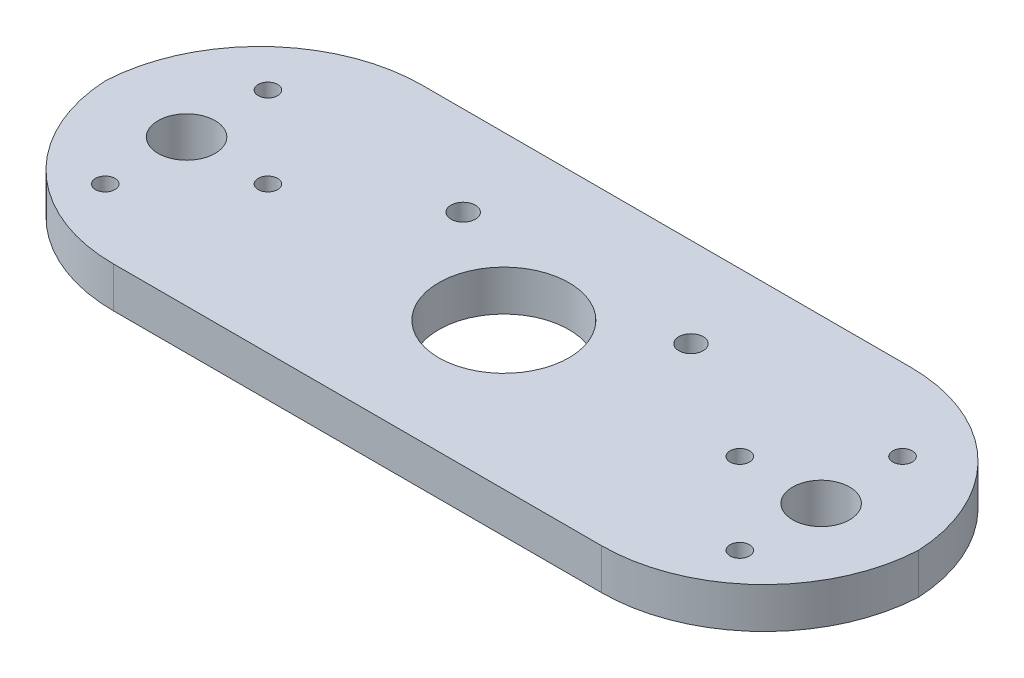
ISO-10303-21;
HEADER;
FILE_DESCRIPTION(('STEP AP214'),'2;1');
FILE_NAME('part.step','',(''),(''),'','','');
FILE_SCHEMA(('AUTOMOTIVE_DESIGN { 1 0 10303 214 1 1 1 1 }'));
ENDSEC;
DATA;
#1=APPLICATION_CONTEXT('core data for automotive mechanical design processes');
#2=APPLICATION_PROTOCOL_DEFINITION('international standard','automotive_design',2000,#1);
#3=PRODUCT_CONTEXT('',#1,'mechanical');
#4=PRODUCT('Part','Part','',(#3));
#5=PRODUCT_RELATED_PRODUCT_CATEGORY('part','',(#4));
#6=PRODUCT_DEFINITION_FORMATION('','',#4);
#7=PRODUCT_DEFINITION_CONTEXT('part definition',#1,'design');
#8=PRODUCT_DEFINITION('design','',#6,#7);
#9=PRODUCT_DEFINITION_SHAPE('','',#8);
#10=(LENGTH_UNIT() NAMED_UNIT(*) SI_UNIT(.MILLI.,.METRE.));
#11=(NAMED_UNIT(*) PLANE_ANGLE_UNIT() SI_UNIT($,.RADIAN.));
#12=(NAMED_UNIT(*) SI_UNIT($,.STERADIAN.) SOLID_ANGLE_UNIT());
#13=UNCERTAINTY_MEASURE_WITH_UNIT(LENGTH_MEASURE(1.E-05),#10,'distance_accuracy_value','');
#14=(GEOMETRIC_REPRESENTATION_CONTEXT(3) GLOBAL_UNCERTAINTY_ASSIGNED_CONTEXT((#13)) GLOBAL_UNIT_ASSIGNED_CONTEXT((#10,
#11,#12)) REPRESENTATION_CONTEXT('',''));
#15=CARTESIAN_POINT('',(0.,0.,0.));
#16=DIRECTION('',(0.,0.,1.));
#17=DIRECTION('',(1.,0.,0.));
#18=AXIS2_PLACEMENT_3D('',#15,#16,#17);
#19=CARTESIAN_POINT('',(0.,5.,0.));
#20=DIRECTION('',(0.,1.,0.));
#21=DIRECTION('',(0.,0.,1.));
#22=AXIS2_PLACEMENT_3D('',#19,#20,#21);
#23=PLANE('',#22);
#24=CARTESIAN_POINT('',(-39.0000000000007,5.,-9.99999999999995));
#25=DIRECTION('',(0.,1.,0.));
#26=DIRECTION('',(0.,0.,1.));
#27=AXIS2_PLACEMENT_3D('',#24,#25,#26);
#28=CIRCLE('',#27,1.19999999999999);
#29=CARTESIAN_POINT('',(-39.0000000000007,5.,-8.79999999999997));
#30=VERTEX_POINT('',#29);
#31=EDGE_CURVE('E368',#30,#30,#28,.T.);
#32=ORIENTED_EDGE('',*,*,#31,.F.);
#33=EDGE_LOOP('',(#32));
#34=FACE_BOUND('',#33,.T.);
#35=CARTESIAN_POINT('',(-39.0000000000007,5.,10.));
#36=DIRECTION('',(0.,1.,0.));
#37=DIRECTION('',(0.,0.,1.));
#38=AXIS2_PLACEMENT_3D('',#35,#36,#37);
#39=CIRCLE('',#38,1.19999999999999);
#40=CARTESIAN_POINT('',(-39.0000000000007,5.,11.2));
#41=VERTEX_POINT('',#40);
#42=EDGE_CURVE('E370',#41,#41,#39,.T.);
#43=ORIENTED_EDGE('',*,*,#42,.F.);
#44=EDGE_LOOP('',(#43));
#45=FACE_BOUND('',#44,.T.);
#46=CARTESIAN_POINT('',(-29.0000000000007,5.,0.));
#47=DIRECTION('',(0.,1.,0.));
#48=DIRECTION('',(0.,0.,1.));
#49=AXIS2_PLACEMENT_3D('',#46,#47,#48);
#50=CIRCLE('',#49,1.19999999999999);
#51=CARTESIAN_POINT('',(-29.0000000000007,5.,1.20000000000003));
#52=VERTEX_POINT('',#51);
#53=EDGE_CURVE('E378',#52,#52,#50,.T.);
#54=ORIENTED_EDGE('',*,*,#53,.F.);
#55=EDGE_LOOP('',(#54));
#56=FACE_BOUND('',#55,.T.);
#57=CARTESIAN_POINT('',(39.0000000000007,5.,-9.99999999999995));
#58=DIRECTION('',(0.,1.,0.));
#59=DIRECTION('',(0.,0.,1.));
#60=AXIS2_PLACEMENT_3D('',#57,#58,#59);
#61=CIRCLE('',#60,1.19999999999999);
#62=CARTESIAN_POINT('',(39.0000000000007,5.,-8.79999999999997));
#63=VERTEX_POINT('',#62);
#64=EDGE_CURVE('E384',#63,#63,#61,.T.);
#65=ORIENTED_EDGE('',*,*,#64,.F.);
#66=EDGE_LOOP('',(#65));
#67=FACE_BOUND('',#66,.T.);
#68=CARTESIAN_POINT('',(39.0000000000007,5.,10.));
#69=DIRECTION('',(0.,1.,0.));
#70=DIRECTION('',(0.,0.,1.));
#71=AXIS2_PLACEMENT_3D('',#68,#69,#70);
#72=CIRCLE('',#71,1.19999999999999);
#73=CARTESIAN_POINT('',(39.0000000000007,5.,11.2));
#74=VERTEX_POINT('',#73);
#75=EDGE_CURVE('E390',#74,#74,#72,.T.);
#76=ORIENTED_EDGE('',*,*,#75,.F.);
#77=EDGE_LOOP('',(#76));
#78=FACE_BOUND('',#77,.T.);
#79=CARTESIAN_POINT('',(29.0000000000007,5.,0.));
#80=DIRECTION('',(0.,1.,0.));
#81=DIRECTION('',(0.,0.,1.));
#82=AXIS2_PLACEMENT_3D('',#79,#80,#81);
#83=CIRCLE('',#82,1.19999999999999);
#84=CARTESIAN_POINT('',(29.0000000000007,5.,1.20000000000003));
#85=VERTEX_POINT('',#84);
#86=EDGE_CURVE('E396',#85,#85,#83,.T.);
#87=ORIENTED_EDGE('',*,*,#86,.F.);
#88=EDGE_LOOP('',(#87));
#89=FACE_BOUND('',#88,.T.);
#90=CARTESIAN_POINT('',(14.0000000000001,5.,-8.99999999999908));
#91=DIRECTION('',(0.,1.,0.));
#92=DIRECTION('',(0.,0.,1.));
#93=AXIS2_PLACEMENT_3D('',#90,#91,#92);
#94=CIRCLE('',#93,1.49999999999999);
#95=CARTESIAN_POINT('',(14.0000000000001,5.,-7.49999999999909));
#96=VERTEX_POINT('',#95);
#97=EDGE_CURVE('E402',#96,#96,#94,.T.);
#98=ORIENTED_EDGE('',*,*,#97,.F.);
#99=EDGE_LOOP('',(#98));
#100=FACE_BOUND('',#99,.T.);
#101=CARTESIAN_POINT('',(-14.,5.,-8.99999999999908));
#102=DIRECTION('',(0.,1.,0.));
#103=DIRECTION('',(0.,0.,1.));
#104=AXIS2_PLACEMENT_3D('',#101,#102,#103);
#105=CIRCLE('',#104,1.49999999999999);
#106=CARTESIAN_POINT('',(-14.,5.,-7.49999999999909));
#107=VERTEX_POINT('',#106);
#108=EDGE_CURVE('E138',#107,#107,#105,.T.);
#109=ORIENTED_EDGE('',*,*,#108,.F.);
#110=EDGE_LOOP('',(#109));
#111=FACE_BOUND('',#110,.T.);
#112=CARTESIAN_POINT('',(39.,5.,0.));
#113=DIRECTION('',(0.,1.,0.));
#114=DIRECTION('',(0.,0.,1.));
#115=AXIS2_PLACEMENT_3D('',#112,#113,#114);
#116=CIRCLE('',#115,3.5);
#117=CARTESIAN_POINT('',(39.,5.,3.5));
#118=VERTEX_POINT('',#117);
#119=EDGE_CURVE('E150',#118,#118,#116,.T.);
#120=ORIENTED_EDGE('',*,*,#119,.F.);
#121=EDGE_LOOP('',(#120));
#122=FACE_BOUND('',#121,.T.);
#123=DIRECTION('',(-1.,0.,0.));
#124=VECTOR('',#123,1.);
#125=CARTESIAN_POINT('',(-50.,5.,-20.));
#126=LINE('',#125,#124);
#127=CARTESIAN_POINT('',(30.,5.,-20.));
#128=VERTEX_POINT('',#127);
#129=CARTESIAN_POINT('',(-30.,5.,-20.));
#130=VERTEX_POINT('',#129);
#131=EDGE_CURVE('E102',#128,#130,#126,.T.);
#132=ORIENTED_EDGE('',*,*,#131,.T.);
#133=CARTESIAN_POINT('',(-30.,5.,0.));
#134=DIRECTION('',(0.,1.,0.));
#135=DIRECTION('',(0.,0.,1.));
#136=AXIS2_PLACEMENT_3D('',#133,#134,#135);
#137=CIRCLE('',#136,20.);
#138=CARTESIAN_POINT('',(-49.9749843554382,5.,-1.));
#139=VERTEX_POINT('',#138);
#140=EDGE_CURVE('E50',#130,#139,#137,.T.);
#141=ORIENTED_EDGE('',*,*,#140,.T.);
#142=CARTESIAN_POINT('',(-30.,5.,-2.00000000000001));
#143=DIRECTION('',(0.,1.,0.));
#144=DIRECTION('',(0.,0.,1.));
#145=AXIS2_PLACEMENT_3D('',#142,#143,#144);
#146=CIRCLE('',#145,20.);
#147=CARTESIAN_POINT('',(-30.,5.,18.));
#148=VERTEX_POINT('',#147);
#149=EDGE_CURVE('E125',#139,#148,#146,.T.);
#150=ORIENTED_EDGE('',*,*,#149,.T.);
#151=DIRECTION('',(1.,0.,0.));
#152=VECTOR('',#151,1.);
#153=CARTESIAN_POINT('',(-50.,5.,18.));
#154=LINE('',#153,#152);
#155=CARTESIAN_POINT('',(30.,5.,18.));
#156=VERTEX_POINT('',#155);
#157=EDGE_CURVE('E92',#148,#156,#154,.T.);
#158=ORIENTED_EDGE('',*,*,#157,.T.);
#159=CARTESIAN_POINT('',(30.,5.,-2.00000000000001));
#160=DIRECTION('',(0.,1.,0.));
#161=DIRECTION('',(0.,0.,1.));
#162=AXIS2_PLACEMENT_3D('',#159,#160,#161);
#163=CIRCLE('',#162,20.);
#164=CARTESIAN_POINT('',(49.9749843554382,5.,-0.999999999999935));
#165=VERTEX_POINT('',#164);
#166=EDGE_CURVE('E57',#156,#165,#163,.T.);
#167=ORIENTED_EDGE('',*,*,#166,.T.);
#168=CARTESIAN_POINT('',(30.,5.,0.));
#169=DIRECTION('',(0.,1.,0.));
#170=DIRECTION('',(0.,0.,1.));
#171=AXIS2_PLACEMENT_3D('',#168,#169,#170);
#172=CIRCLE('',#171,20.);
#173=EDGE_CURVE('E123',#165,#128,#172,.T.);
#174=ORIENTED_EDGE('',*,*,#173,.T.);
#175=EDGE_LOOP('',(#132,#141,#150,#158,#167,#174));
#176=FACE_BOUND('',#175,.T.);
#177=CARTESIAN_POINT('',(-3.10088955633979E-12,5.,3.71938256118619E-12));
#178=DIRECTION('',(0.,1.,0.));
#179=DIRECTION('',(0.,0.,1.));
#180=AXIS2_PLACEMENT_3D('',#177,#178,#179);
#181=CIRCLE('',#180,8.00000000000408);
#182=CARTESIAN_POINT('',(-3.10088955633979E-12,5.,8.0000000000078));
#183=VERTEX_POINT('',#182);
#184=EDGE_CURVE('E156',#183,#183,#181,.T.);
#185=ORIENTED_EDGE('',*,*,#184,.F.);
#186=EDGE_LOOP('',(#185));
#187=FACE_BOUND('',#186,.T.);
#188=CARTESIAN_POINT('',(-39.,5.,0.));
#189=DIRECTION('',(0.,1.,0.));
#190=DIRECTION('',(0.,0.,-1.));
#191=AXIS2_PLACEMENT_3D('',#188,#189,#190);
#192=CIRCLE('',#191,3.5);
#193=CARTESIAN_POINT('',(-39.,5.,-3.5));
#194=VERTEX_POINT('',#193);
#195=EDGE_CURVE('E131',#194,#194,#192,.T.);
#196=ORIENTED_EDGE('',*,*,#195,.F.);
#197=EDGE_LOOP('',(#196));
#198=FACE_BOUND('',#197,.T.);
#199=ADVANCED_FACE('F33',(#34,#45,#56,#67,#78,#89,#100,#111,#122,#176,#187,#198),#23,.T.);
#200=CARTESIAN_POINT('',(0.,0.,0.));
#201=DIRECTION('',(0.,1.,0.));
#202=DIRECTION('',(0.,0.,1.));
#203=AXIS2_PLACEMENT_3D('',#200,#201,#202);
#204=PLANE('',#203);
#205=CARTESIAN_POINT('',(-39.0000000000007,0.,-9.99999999999995));
#206=DIRECTION('',(0.,1.,0.));
#207=DIRECTION('',(0.,0.,1.));
#208=AXIS2_PLACEMENT_3D('',#205,#206,#207);
#209=CIRCLE('',#208,1.19999999999999);
#210=CARTESIAN_POINT('',(-39.0000000000007,0.,-8.79999999999997));
#211=VERTEX_POINT('',#210);
#212=EDGE_CURVE('E366',#211,#211,#209,.T.);
#213=ORIENTED_EDGE('',*,*,#212,.T.);
#214=EDGE_LOOP('',(#213));
#215=FACE_BOUND('',#214,.T.);
#216=CARTESIAN_POINT('',(-39.0000000000007,0.,10.));
#217=DIRECTION('',(0.,1.,0.));
#218=DIRECTION('',(0.,0.,1.));
#219=AXIS2_PLACEMENT_3D('',#216,#217,#218);
#220=CIRCLE('',#219,1.19999999999999);
#221=CARTESIAN_POINT('',(-39.0000000000007,0.,11.2));
#222=VERTEX_POINT('',#221);
#223=EDGE_CURVE('E375',#222,#222,#220,.T.);
#224=ORIENTED_EDGE('',*,*,#223,.T.);
#225=EDGE_LOOP('',(#224));
#226=FACE_BOUND('',#225,.T.);
#227=CARTESIAN_POINT('',(-29.0000000000007,0.,0.));
#228=DIRECTION('',(0.,1.,0.));
#229=DIRECTION('',(0.,0.,1.));
#230=AXIS2_PLACEMENT_3D('',#227,#228,#229);
#231=CIRCLE('',#230,1.19999999999999);
#232=CARTESIAN_POINT('',(-29.0000000000007,0.,1.20000000000003));
#233=VERTEX_POINT('',#232);
#234=EDGE_CURVE('E381',#233,#233,#231,.T.);
#235=ORIENTED_EDGE('',*,*,#234,.T.);
#236=EDGE_LOOP('',(#235));
#237=FACE_BOUND('',#236,.T.);
#238=CARTESIAN_POINT('',(39.0000000000007,0.,-9.99999999999995));
#239=DIRECTION('',(0.,1.,0.));
#240=DIRECTION('',(0.,0.,1.));
#241=AXIS2_PLACEMENT_3D('',#238,#239,#240);
#242=CIRCLE('',#241,1.19999999999999);
#243=CARTESIAN_POINT('',(39.0000000000007,0.,-8.79999999999997));
#244=VERTEX_POINT('',#243);
#245=EDGE_CURVE('E387',#244,#244,#242,.T.);
#246=ORIENTED_EDGE('',*,*,#245,.T.);
#247=EDGE_LOOP('',(#246));
#248=FACE_BOUND('',#247,.T.);
#249=CARTESIAN_POINT('',(39.0000000000007,0.,10.));
#250=DIRECTION('',(0.,1.,0.));
#251=DIRECTION('',(0.,0.,1.));
#252=AXIS2_PLACEMENT_3D('',#249,#250,#251);
#253=CIRCLE('',#252,1.19999999999999);
#254=CARTESIAN_POINT('',(39.0000000000007,0.,11.2));
#255=VERTEX_POINT('',#254);
#256=EDGE_CURVE('E393',#255,#255,#253,.T.);
#257=ORIENTED_EDGE('',*,*,#256,.T.);
#258=EDGE_LOOP('',(#257));
#259=FACE_BOUND('',#258,.T.);
#260=CARTESIAN_POINT('',(29.0000000000007,0.,0.));
#261=DIRECTION('',(0.,1.,0.));
#262=DIRECTION('',(0.,0.,1.));
#263=AXIS2_PLACEMENT_3D('',#260,#261,#262);
#264=CIRCLE('',#263,1.19999999999999);
#265=CARTESIAN_POINT('',(29.0000000000007,0.,1.20000000000003));
#266=VERTEX_POINT('',#265);
#267=EDGE_CURVE('E399',#266,#266,#264,.T.);
#268=ORIENTED_EDGE('',*,*,#267,.T.);
#269=EDGE_LOOP('',(#268));
#270=FACE_BOUND('',#269,.T.);
#271=CARTESIAN_POINT('',(14.0000000000001,0.,-8.99999999999908));
#272=DIRECTION('',(0.,1.,0.));
#273=DIRECTION('',(0.,0.,1.));
#274=AXIS2_PLACEMENT_3D('',#271,#272,#273);
#275=CIRCLE('',#274,1.49999999999999);
#276=CARTESIAN_POINT('',(14.0000000000001,0.,-7.49999999999909));
#277=VERTEX_POINT('',#276);
#278=EDGE_CURVE('E143',#277,#277,#275,.T.);
#279=ORIENTED_EDGE('',*,*,#278,.T.);
#280=EDGE_LOOP('',(#279));
#281=FACE_BOUND('',#280,.T.);
#282=CARTESIAN_POINT('',(-14.,0.,-8.99999999999908));
#283=DIRECTION('',(0.,1.,0.));
#284=DIRECTION('',(0.,0.,1.));
#285=AXIS2_PLACEMENT_3D('',#282,#283,#284);
#286=CIRCLE('',#285,1.49999999999999);
#287=CARTESIAN_POINT('',(-14.,0.,-7.49999999999909));
#288=VERTEX_POINT('',#287);
#289=EDGE_CURVE('E134',#288,#288,#286,.T.);
#290=ORIENTED_EDGE('',*,*,#289,.T.);
#291=EDGE_LOOP('',(#290));
#292=FACE_BOUND('',#291,.T.);
#293=CARTESIAN_POINT('',(-30.,0.,-2.00000000000001));
#294=DIRECTION('',(0.,1.,0.));
#295=DIRECTION('',(0.,0.,1.));
#296=AXIS2_PLACEMENT_3D('',#293,#294,#295);
#297=CIRCLE('',#296,20.);
#298=CARTESIAN_POINT('',(-30.,0.,18.));
#299=VERTEX_POINT('',#298);
#300=CARTESIAN_POINT('',(-49.9749843554382,0.,-1.));
#301=VERTEX_POINT('',#300);
#302=EDGE_CURVE('E98',#299,#301,#297,.F.);
#303=ORIENTED_EDGE('',*,*,#302,.T.);
#304=CARTESIAN_POINT('',(-30.,0.,0.));
#305=DIRECTION('',(0.,1.,0.));
#306=DIRECTION('',(0.,0.,1.));
#307=AXIS2_PLACEMENT_3D('',#304,#305,#306);
#308=CIRCLE('',#307,20.);
#309=CARTESIAN_POINT('',(-30.,0.,-20.));
#310=VERTEX_POINT('',#309);
#311=EDGE_CURVE('E109',#301,#310,#308,.F.);
#312=ORIENTED_EDGE('',*,*,#311,.T.);
#313=DIRECTION('',(-1.,0.,0.));
#314=VECTOR('',#313,1.);
#315=CARTESIAN_POINT('',(-50.,0.,-20.));
#316=LINE('',#315,#314);
#317=CARTESIAN_POINT('',(30.,0.,-20.));
#318=VERTEX_POINT('',#317);
#319=EDGE_CURVE('E103',#318,#310,#316,.T.);
#320=ORIENTED_EDGE('',*,*,#319,.F.);
#321=CARTESIAN_POINT('',(30.,0.,0.));
#322=DIRECTION('',(0.,1.,0.));
#323=DIRECTION('',(0.,0.,1.));
#324=AXIS2_PLACEMENT_3D('',#321,#322,#323);
#325=CIRCLE('',#324,20.);
#326=CARTESIAN_POINT('',(49.9749843554382,0.,-0.999999999999935));
#327=VERTEX_POINT('',#326);
#328=EDGE_CURVE('E110',#318,#327,#325,.F.);
#329=ORIENTED_EDGE('',*,*,#328,.T.);
#330=CARTESIAN_POINT('',(30.,0.,-2.00000000000001));
#331=DIRECTION('',(0.,1.,0.));
#332=DIRECTION('',(0.,0.,1.));
#333=AXIS2_PLACEMENT_3D('',#330,#331,#332);
#334=CIRCLE('',#333,20.);
#335=CARTESIAN_POINT('',(30.,0.,18.));
#336=VERTEX_POINT('',#335);
#337=EDGE_CURVE('E101',#327,#336,#334,.F.);
#338=ORIENTED_EDGE('',*,*,#337,.T.);
#339=DIRECTION('',(1.,0.,0.));
#340=VECTOR('',#339,1.);
#341=CARTESIAN_POINT('',(-50.,0.,18.));
#342=LINE('',#341,#340);
#343=EDGE_CURVE('E90',#299,#336,#342,.T.);
#344=ORIENTED_EDGE('',*,*,#343,.F.);
#345=EDGE_LOOP('',(#303,#312,#320,#329,#338,#344));
#346=FACE_BOUND('',#345,.T.);
#347=CARTESIAN_POINT('',(-3.10088955633979E-12,0.,3.71938256118619E-12));
#348=DIRECTION('',(0.,1.,0.));
#349=DIRECTION('',(0.,0.,1.));
#350=AXIS2_PLACEMENT_3D('',#347,#348,#349);
#351=CIRCLE('',#350,8.00000000000408);
#352=CARTESIAN_POINT('',(-3.10088955633979E-12,0.,8.0000000000078));
#353=VERTEX_POINT('',#352);
#354=EDGE_CURVE('E153',#353,#353,#351,.T.);
#355=ORIENTED_EDGE('',*,*,#354,.T.);
#356=EDGE_LOOP('',(#355));
#357=FACE_BOUND('',#356,.T.);
#358=CARTESIAN_POINT('',(39.,0.,0.));
#359=DIRECTION('',(0.,1.,0.));
#360=DIRECTION('',(0.,0.,1.));
#361=AXIS2_PLACEMENT_3D('',#358,#359,#360);
#362=CIRCLE('',#361,3.5);
#363=CARTESIAN_POINT('',(39.,0.,3.5));
#364=VERTEX_POINT('',#363);
#365=EDGE_CURVE('E148',#364,#364,#362,.T.);
#366=ORIENTED_EDGE('',*,*,#365,.T.);
#367=EDGE_LOOP('',(#366));
#368=FACE_BOUND('',#367,.T.);
#369=CARTESIAN_POINT('',(-39.,0.,0.));
#370=DIRECTION('',(0.,1.,0.));
#371=DIRECTION('',(0.,0.,-1.));
#372=AXIS2_PLACEMENT_3D('',#369,#370,#371);
#373=CIRCLE('',#372,3.5);
#374=CARTESIAN_POINT('',(-39.,0.,-3.5));
#375=VERTEX_POINT('',#374);
#376=EDGE_CURVE('E128',#375,#375,#373,.T.);
#377=ORIENTED_EDGE('',*,*,#376,.T.);
#378=EDGE_LOOP('',(#377));
#379=FACE_BOUND('',#378,.T.);
#380=ADVANCED_FACE('F96',(#215,#226,#237,#248,#259,#270,#281,#292,#346,#357,#368,#379),#204,.F.);
#381=CARTESIAN_POINT('',(-50.,5.,-20.));
#382=DIRECTION('',(0.,0.,1.));
#383=DIRECTION('',(1.,0.,0.));
#384=AXIS2_PLACEMENT_3D('',#381,#382,#383);
#385=PLANE('',#384);
#386=ORIENTED_EDGE('',*,*,#319,.T.);
#387=DIRECTION('',(0.,-1.,0.));
#388=VECTOR('',#387,1.);
#389=CARTESIAN_POINT('',(-30.,5.,-20.));
#390=LINE('',#389,#388);
#391=EDGE_CURVE('E119',#310,#130,#390,.F.);
#392=ORIENTED_EDGE('',*,*,#391,.T.);
#393=ORIENTED_EDGE('',*,*,#131,.F.);
#394=DIRECTION('',(0.,-1.,0.));
#395=VECTOR('',#394,1.);
#396=CARTESIAN_POINT('',(30.,5.,-20.));
#397=LINE('',#396,#395);
#398=EDGE_CURVE('E112',#128,#318,#397,.T.);
#399=ORIENTED_EDGE('',*,*,#398,.T.);
#400=EDGE_LOOP('',(#386,#392,#393,#399));
#401=FACE_BOUND('',#400,.T.);
#402=ADVANCED_FACE('F167',(#401),#385,.F.);
#403=CARTESIAN_POINT('',(-50.,5.,18.));
#404=DIRECTION('',(0.,0.,-1.));
#405=DIRECTION('',(-1.,0.,0.));
#406=AXIS2_PLACEMENT_3D('',#403,#404,#405);
#407=PLANE('',#406);
#408=ORIENTED_EDGE('',*,*,#157,.F.);
#409=DIRECTION('',(0.,-1.,0.));
#410=VECTOR('',#409,1.);
#411=CARTESIAN_POINT('',(-30.,5.,18.));
#412=LINE('',#411,#410);
#413=EDGE_CURVE('E11',#148,#299,#412,.T.);
#414=ORIENTED_EDGE('',*,*,#413,.T.);
#415=ORIENTED_EDGE('',*,*,#343,.T.);
#416=DIRECTION('',(0.,-1.,0.));
#417=VECTOR('',#416,1.);
#418=CARTESIAN_POINT('',(30.,5.,18.));
#419=LINE('',#418,#417);
#420=EDGE_CURVE('E42',#336,#156,#419,.F.);
#421=ORIENTED_EDGE('',*,*,#420,.T.);
#422=EDGE_LOOP('',(#408,#414,#415,#421));
#423=FACE_BOUND('',#422,.T.);
#424=ADVANCED_FACE('F89',(#423),#407,.F.);
#425=CARTESIAN_POINT('',(-3.10088955633979E-12,5.,3.71938256118619E-12));
#426=DIRECTION('',(0.,-1.,0.));
#427=DIRECTION('',(0.,0.,-1.));
#428=AXIS2_PLACEMENT_3D('',#425,#426,#427);
#429=CYLINDRICAL_SURFACE('',#428,8.00000000000408);
#430=ORIENTED_EDGE('',*,*,#184,.T.);
#431=EDGE_LOOP('',(#430));
#432=FACE_BOUND('',#431,.T.);
#433=ORIENTED_EDGE('',*,*,#354,.F.);
#434=EDGE_LOOP('',(#433));
#435=FACE_BOUND('',#434,.T.);
#436=ADVANCED_FACE('F194',(#432,#435),#429,.F.);
#437=CARTESIAN_POINT('',(39.,5.,0.));
#438=DIRECTION('',(0.,-1.,0.));
#439=DIRECTION('',(0.,0.,-1.));
#440=AXIS2_PLACEMENT_3D('',#437,#438,#439);
#441=CYLINDRICAL_SURFACE('',#440,3.5);
#442=ORIENTED_EDGE('',*,*,#119,.T.);
#443=EDGE_LOOP('',(#442));
#444=FACE_BOUND('',#443,.T.);
#445=ORIENTED_EDGE('',*,*,#365,.F.);
#446=EDGE_LOOP('',(#445));
#447=FACE_BOUND('',#446,.T.);
#448=ADVANCED_FACE('F319',(#444,#447),#441,.F.);
#449=CARTESIAN_POINT('',(-39.,5.,0.));
#450=DIRECTION('',(0.,-1.,0.));
#451=DIRECTION('',(0.,0.,-1.));
#452=AXIS2_PLACEMENT_3D('',#449,#450,#451);
#453=CYLINDRICAL_SURFACE('',#452,3.5);
#454=ORIENTED_EDGE('',*,*,#195,.T.);
#455=EDGE_LOOP('',(#454));
#456=FACE_BOUND('',#455,.T.);
#457=ORIENTED_EDGE('',*,*,#376,.F.);
#458=EDGE_LOOP('',(#457));
#459=FACE_BOUND('',#458,.T.);
#460=ADVANCED_FACE('F179',(#456,#459),#453,.F.);
#461=CARTESIAN_POINT('',(-30.,5.,-2.00000000000001));
#462=DIRECTION('',(0.,-1.,0.));
#463=DIRECTION('',(0.,0.,-1.));
#464=AXIS2_PLACEMENT_3D('',#461,#462,#463);
#465=CYLINDRICAL_SURFACE('',#464,20.);
#466=ORIENTED_EDGE('',*,*,#413,.F.);
#467=ORIENTED_EDGE('',*,*,#149,.F.);
#468=DIRECTION('',(0.,-1.,0.));
#469=VECTOR('',#468,1.);
#470=CARTESIAN_POINT('',(-49.9749843554382,2.5,-1.));
#471=LINE('',#470,#469);
#472=EDGE_CURVE('E107',#301,#139,#471,.F.);
#473=ORIENTED_EDGE('',*,*,#472,.F.);
#474=ORIENTED_EDGE('',*,*,#302,.F.);
#475=EDGE_LOOP('',(#466,#467,#473,#474));
#476=FACE_BOUND('',#475,.T.);
#477=ADVANCED_FACE('F105',(#476),#465,.T.);
#478=CARTESIAN_POINT('',(-30.,5.,0.));
#479=DIRECTION('',(0.,-1.,0.));
#480=DIRECTION('',(0.,0.,-1.));
#481=AXIS2_PLACEMENT_3D('',#478,#479,#480);
#482=CYLINDRICAL_SURFACE('',#481,20.);
#483=ORIENTED_EDGE('',*,*,#140,.F.);
#484=ORIENTED_EDGE('',*,*,#391,.F.);
#485=ORIENTED_EDGE('',*,*,#311,.F.);
#486=ORIENTED_EDGE('',*,*,#472,.T.);
#487=EDGE_LOOP('',(#483,#484,#485,#486));
#488=FACE_BOUND('',#487,.T.);
#489=ADVANCED_FACE('F170',(#488),#482,.T.);
#490=CARTESIAN_POINT('',(30.,5.,-2.00000000000001));
#491=DIRECTION('',(0.,-1.,0.));
#492=DIRECTION('',(0.,0.,-1.));
#493=AXIS2_PLACEMENT_3D('',#490,#491,#492);
#494=CYLINDRICAL_SURFACE('',#493,20.);
#495=DIRECTION('',(0.,-1.,0.));
#496=VECTOR('',#495,1.);
#497=CARTESIAN_POINT('',(49.9749843554382,2.5,-0.999999999999935));
#498=LINE('',#497,#496);
#499=EDGE_CURVE('E37',#165,#327,#498,.T.);
#500=ORIENTED_EDGE('',*,*,#499,.F.);
#501=ORIENTED_EDGE('',*,*,#166,.F.);
#502=ORIENTED_EDGE('',*,*,#420,.F.);
#503=ORIENTED_EDGE('',*,*,#337,.F.);
#504=EDGE_LOOP('',(#500,#501,#502,#503));
#505=FACE_BOUND('',#504,.T.);
#506=ADVANCED_FACE('F35',(#505),#494,.T.);
#507=CARTESIAN_POINT('',(30.,5.,0.));
#508=DIRECTION('',(0.,-1.,0.));
#509=DIRECTION('',(0.,0.,-1.));
#510=AXIS2_PLACEMENT_3D('',#507,#508,#509);
#511=CYLINDRICAL_SURFACE('',#510,20.);
#512=ORIENTED_EDGE('',*,*,#173,.F.);
#513=ORIENTED_EDGE('',*,*,#499,.T.);
#514=ORIENTED_EDGE('',*,*,#328,.F.);
#515=ORIENTED_EDGE('',*,*,#398,.F.);
#516=EDGE_LOOP('',(#512,#513,#514,#515));
#517=FACE_BOUND('',#516,.T.);
#518=ADVANCED_FACE('F177',(#517),#511,.T.);
#519=CARTESIAN_POINT('',(-14.,5.,-8.99999999999908));
#520=DIRECTION('',(0.,1.,0.));
#521=DIRECTION('',(0.,0.,1.));
#522=AXIS2_PLACEMENT_3D('',#519,#520,#521);
#523=CYLINDRICAL_SURFACE('',#522,1.49999999999999);
#524=ORIENTED_EDGE('',*,*,#289,.F.);
#525=EDGE_LOOP('',(#524));
#526=FACE_BOUND('',#525,.T.);
#527=ORIENTED_EDGE('',*,*,#108,.T.);
#528=EDGE_LOOP('',(#527));
#529=FACE_BOUND('',#528,.T.);
#530=ADVANCED_FACE('F235',(#526,#529),#523,.F.);
#531=CARTESIAN_POINT('',(14.0000000000001,5.,-8.99999999999908));
#532=DIRECTION('',(0.,1.,0.));
#533=DIRECTION('',(0.,0.,1.));
#534=AXIS2_PLACEMENT_3D('',#531,#532,#533);
#535=CYLINDRICAL_SURFACE('',#534,1.49999999999999);
#536=ORIENTED_EDGE('',*,*,#278,.F.);
#537=EDGE_LOOP('',(#536));
#538=FACE_BOUND('',#537,.T.);
#539=ORIENTED_EDGE('',*,*,#97,.T.);
#540=EDGE_LOOP('',(#539));
#541=FACE_BOUND('',#540,.T.);
#542=ADVANCED_FACE('F243',(#538,#541),#535,.F.);
#543=CARTESIAN_POINT('',(29.0000000000007,5.,0.));
#544=DIRECTION('',(0.,1.,0.));
#545=DIRECTION('',(0.,0.,1.));
#546=AXIS2_PLACEMENT_3D('',#543,#544,#545);
#547=CYLINDRICAL_SURFACE('',#546,1.19999999999999);
#548=ORIENTED_EDGE('',*,*,#267,.F.);
#549=EDGE_LOOP('',(#548));
#550=FACE_BOUND('',#549,.T.);
#551=ORIENTED_EDGE('',*,*,#86,.T.);
#552=EDGE_LOOP('',(#551));
#553=FACE_BOUND('',#552,.T.);
#554=ADVANCED_FACE('F253',(#550,#553),#547,.F.);
#555=CARTESIAN_POINT('',(39.0000000000007,5.,10.));
#556=DIRECTION('',(0.,1.,0.));
#557=DIRECTION('',(0.,0.,1.));
#558=AXIS2_PLACEMENT_3D('',#555,#556,#557);
#559=CYLINDRICAL_SURFACE('',#558,1.19999999999999);
#560=ORIENTED_EDGE('',*,*,#256,.F.);
#561=EDGE_LOOP('',(#560));
#562=FACE_BOUND('',#561,.T.);
#563=ORIENTED_EDGE('',*,*,#75,.T.);
#564=EDGE_LOOP('',(#563));
#565=FACE_BOUND('',#564,.T.);
#566=ADVANCED_FACE('F263',(#562,#565),#559,.F.);
#567=CARTESIAN_POINT('',(39.0000000000007,5.,-9.99999999999995));
#568=DIRECTION('',(0.,1.,0.));
#569=DIRECTION('',(0.,0.,1.));
#570=AXIS2_PLACEMENT_3D('',#567,#568,#569);
#571=CYLINDRICAL_SURFACE('',#570,1.19999999999999);
#572=ORIENTED_EDGE('',*,*,#245,.F.);
#573=EDGE_LOOP('',(#572));
#574=FACE_BOUND('',#573,.T.);
#575=ORIENTED_EDGE('',*,*,#64,.T.);
#576=EDGE_LOOP('',(#575));
#577=FACE_BOUND('',#576,.T.);
#578=ADVANCED_FACE('F272',(#574,#577),#571,.F.);
#579=CARTESIAN_POINT('',(-29.0000000000007,5.,0.));
#580=DIRECTION('',(0.,1.,0.));
#581=DIRECTION('',(0.,0.,1.));
#582=AXIS2_PLACEMENT_3D('',#579,#580,#581);
#583=CYLINDRICAL_SURFACE('',#582,1.19999999999999);
#584=ORIENTED_EDGE('',*,*,#234,.F.);
#585=EDGE_LOOP('',(#584));
#586=FACE_BOUND('',#585,.T.);
#587=ORIENTED_EDGE('',*,*,#53,.T.);
#588=EDGE_LOOP('',(#587));
#589=FACE_BOUND('',#588,.T.);
#590=ADVANCED_FACE('F281',(#586,#589),#583,.F.);
#591=CARTESIAN_POINT('',(-39.0000000000007,5.,10.));
#592=DIRECTION('',(0.,1.,0.));
#593=DIRECTION('',(0.,0.,1.));
#594=AXIS2_PLACEMENT_3D('',#591,#592,#593);
#595=CYLINDRICAL_SURFACE('',#594,1.19999999999999);
#596=ORIENTED_EDGE('',*,*,#223,.F.);
#597=EDGE_LOOP('',(#596));
#598=FACE_BOUND('',#597,.T.);
#599=ORIENTED_EDGE('',*,*,#42,.T.);
#600=EDGE_LOOP('',(#599));
#601=FACE_BOUND('',#600,.T.);
#602=ADVANCED_FACE('F292',(#598,#601),#595,.F.);
#603=CARTESIAN_POINT('',(-39.0000000000007,5.,-9.99999999999995));
#604=DIRECTION('',(0.,1.,0.));
#605=DIRECTION('',(0.,0.,1.));
#606=AXIS2_PLACEMENT_3D('',#603,#604,#605);
#607=CYLINDRICAL_SURFACE('',#606,1.19999999999999);
#608=ORIENTED_EDGE('',*,*,#212,.F.);
#609=EDGE_LOOP('',(#608));
#610=FACE_BOUND('',#609,.T.);
#611=ORIENTED_EDGE('',*,*,#31,.T.);
#612=EDGE_LOOP('',(#611));
#613=FACE_BOUND('',#612,.T.);
#614=ADVANCED_FACE('F299',(#610,#613),#607,.F.);
#615=CLOSED_SHELL('',(#199,#380,#402,#424,#436,#448,#460,#477,#489,#506,#518,#530,#542,#554,
#566,#578,#590,#602,#614));
#616=MANIFOLD_SOLID_BREP('B2',#615);
#617=ADVANCED_BREP_SHAPE_REPRESENTATION('',(#18,#616),#14);
#618=SHAPE_DEFINITION_REPRESENTATION(#9,#617);
ENDSEC;
END-ISO-10303-21;
